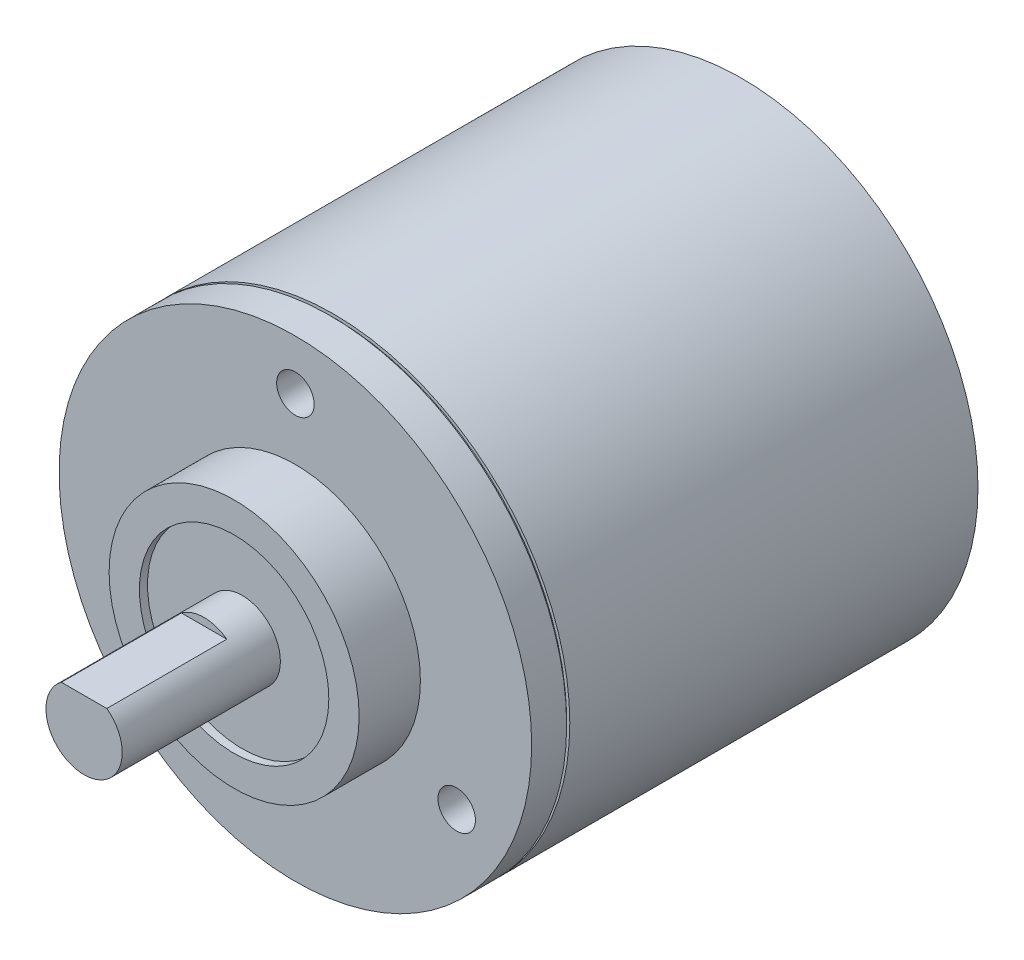
ISO-10303-21;
HEADER;
FILE_DESCRIPTION(('STEP AP214'),'2;1');
FILE_NAME('part.step','',(''),(''),'','','');
FILE_SCHEMA(('AUTOMOTIVE_DESIGN { 1 0 10303 214 1 1 1 1 }'));
ENDSEC;
DATA;
#1=APPLICATION_CONTEXT('core data for automotive mechanical design processes');
#2=APPLICATION_PROTOCOL_DEFINITION('international standard','automotive_design',2000,#1);
#3=PRODUCT_CONTEXT('',#1,'mechanical');
#4=PRODUCT('Part','Part','',(#3));
#5=PRODUCT_RELATED_PRODUCT_CATEGORY('part','',(#4));
#6=PRODUCT_DEFINITION_FORMATION('','',#4);
#7=PRODUCT_DEFINITION_CONTEXT('part definition',#1,'design');
#8=PRODUCT_DEFINITION('design','',#6,#7);
#9=PRODUCT_DEFINITION_SHAPE('','',#8);
#10=(LENGTH_UNIT() NAMED_UNIT(*) SI_UNIT(.MILLI.,.METRE.));
#11=(NAMED_UNIT(*) PLANE_ANGLE_UNIT() SI_UNIT($,.RADIAN.));
#12=(NAMED_UNIT(*) SI_UNIT($,.STERADIAN.) SOLID_ANGLE_UNIT());
#13=UNCERTAINTY_MEASURE_WITH_UNIT(LENGTH_MEASURE(1.E-05),#10,'distance_accuracy_value','');
#14=(GEOMETRIC_REPRESENTATION_CONTEXT(3) GLOBAL_UNCERTAINTY_ASSIGNED_CONTEXT((#13)) GLOBAL_UNIT_ASSIGNED_CONTEXT((#10,
#11,#12)) REPRESENTATION_CONTEXT('',''));
#15=CARTESIAN_POINT('',(0.,0.,0.));
#16=DIRECTION('',(0.,0.,1.));
#17=DIRECTION('',(1.,0.,0.));
#18=AXIS2_PLACEMENT_3D('',#15,#16,#17);
#19=CARTESIAN_POINT('',(0.,0.,-0.1));
#20=DIRECTION('',(0.,0.,1.));
#21=DIRECTION('',(1.,0.,0.));
#22=AXIS2_PLACEMENT_3D('',#19,#20,#21);
#23=CYLINDRICAL_SURFACE('',#22,18.9);
#24=CARTESIAN_POINT('',(0.,0.,32.8));
#25=DIRECTION('',(0.,0.,1.));
#26=DIRECTION('',(1.,0.,0.));
#27=AXIS2_PLACEMENT_3D('',#24,#25,#26);
#28=CIRCLE('',#27,18.9);
#29=CARTESIAN_POINT('',(18.9,0.,32.8));
#30=VERTEX_POINT('',#29);
#31=EDGE_CURVE('E38',#30,#30,#28,.F.);
#32=ORIENTED_EDGE('',*,*,#31,.F.);
#33=EDGE_LOOP('',(#32));
#34=FACE_BOUND('',#33,.T.);
#35=CARTESIAN_POINT('',(0.,0.,35.6));
#36=DIRECTION('',(0.,0.,1.));
#37=DIRECTION('',(1.,0.,0.));
#38=AXIS2_PLACEMENT_3D('',#35,#36,#37);
#39=CIRCLE('',#38,18.9);
#40=CARTESIAN_POINT('',(18.9,0.,35.6));
#41=VERTEX_POINT('',#40);
#42=EDGE_CURVE('E79',#41,#41,#39,.T.);
#43=ORIENTED_EDGE('',*,*,#42,.F.);
#44=EDGE_LOOP('',(#43));
#45=FACE_BOUND('',#44,.T.);
#46=ADVANCED_FACE('F34',(#34,#45),#23,.T.);
#47=CARTESIAN_POINT('',(0.,0.,35.6));
#48=DIRECTION('',(0.,0.,1.));
#49=DIRECTION('',(1.,0.,0.));
#50=AXIS2_PLACEMENT_3D('',#47,#48,#49);
#51=PLANE('',#50);
#52=CARTESIAN_POINT('',(-12.9037785163881,-7.45000000000006,35.6));
#53=DIRECTION('',(0.,0.,1.));
#54=DIRECTION('',(-0.500000000000004,0.866025403784436,0.));
#55=AXIS2_PLACEMENT_3D('',#52,#53,#54);
#56=CIRCLE('',#55,1.5);
#57=CARTESIAN_POINT('',(-13.6537785163881,-6.15096189432341,35.6));
#58=VERTEX_POINT('',#57);
#59=EDGE_CURVE('E112',#58,#58,#56,.T.);
#60=ORIENTED_EDGE('',*,*,#59,.F.);
#61=EDGE_LOOP('',(#60));
#62=FACE_BOUND('',#61,.T.);
#63=CARTESIAN_POINT('',(12.9037785163882,-7.44999999999988,35.6));
#64=DIRECTION('',(0.,0.,1.));
#65=DIRECTION('',(-0.499999999999992,-0.866025403784443,0.));
#66=AXIS2_PLACEMENT_3D('',#63,#64,#65);
#67=CIRCLE('',#66,1.5);
#68=CARTESIAN_POINT('',(12.1537785163882,-8.74903810567655,35.6));
#69=VERTEX_POINT('',#68);
#70=EDGE_CURVE('E101',#69,#69,#67,.T.);
#71=ORIENTED_EDGE('',*,*,#70,.F.);
#72=EDGE_LOOP('',(#71));
#73=FACE_BOUND('',#72,.T.);
#74=CARTESIAN_POINT('',(0.,14.9,35.6));
#75=DIRECTION('',(0.,0.,1.));
#76=DIRECTION('',(1.,0.,0.));
#77=AXIS2_PLACEMENT_3D('',#74,#75,#76);
#78=CIRCLE('',#77,1.5);
#79=CARTESIAN_POINT('',(1.5,14.9,35.6));
#80=VERTEX_POINT('',#79);
#81=EDGE_CURVE('E82',#80,#80,#78,.T.);
#82=ORIENTED_EDGE('',*,*,#81,.F.);
#83=EDGE_LOOP('',(#82));
#84=FACE_BOUND('',#83,.T.);
#85=CARTESIAN_POINT('',(0.,0.,35.6));
#86=DIRECTION('',(0.,0.,1.));
#87=DIRECTION('',(1.,0.,0.));
#88=AXIS2_PLACEMENT_3D('',#85,#86,#87);
#89=CIRCLE('',#88,10.);
#90=CARTESIAN_POINT('',(10.,0.,35.6));
#91=VERTEX_POINT('',#90);
#92=EDGE_CURVE('E86',#91,#91,#89,.T.);
#93=ORIENTED_EDGE('',*,*,#92,.F.);
#94=EDGE_LOOP('',(#93));
#95=FACE_BOUND('',#94,.T.);
#96=ORIENTED_EDGE('',*,*,#42,.T.);
#97=EDGE_LOOP('',(#96));
#98=FACE_BOUND('',#97,.T.);
#99=ADVANCED_FACE('F143',(#62,#73,#84,#95,#98),#51,.T.);
#100=CARTESIAN_POINT('',(0.,0.,40.5));
#101=DIRECTION('',(0.,0.,-1.));
#102=DIRECTION('',(-1.,0.,0.));
#103=AXIS2_PLACEMENT_3D('',#100,#101,#102);
#104=CYLINDRICAL_SURFACE('',#103,10.);
#105=CARTESIAN_POINT('',(0.,0.,40.5));
#106=DIRECTION('',(0.,0.,1.));
#107=DIRECTION('',(1.,0.,0.));
#108=AXIS2_PLACEMENT_3D('',#105,#106,#107);
#109=CIRCLE('',#108,10.);
#110=CARTESIAN_POINT('',(10.,0.,40.5));
#111=VERTEX_POINT('',#110);
#112=EDGE_CURVE('E75',#111,#111,#109,.T.);
#113=ORIENTED_EDGE('',*,*,#112,.F.);
#114=EDGE_LOOP('',(#113));
#115=FACE_BOUND('',#114,.T.);
#116=ORIENTED_EDGE('',*,*,#92,.T.);
#117=EDGE_LOOP('',(#116));
#118=FACE_BOUND('',#117,.T.);
#119=ADVANCED_FACE('F137',(#115,#118),#104,.T.);
#120=CARTESIAN_POINT('',(0.,0.,40.5));
#121=DIRECTION('',(0.,0.,1.));
#122=DIRECTION('',(1.,0.,0.));
#123=AXIS2_PLACEMENT_3D('',#120,#121,#122);
#124=PLANE('',#123);
#125=CARTESIAN_POINT('',(0.,0.,40.5));
#126=DIRECTION('',(0.,0.,1.));
#127=DIRECTION('',(1.,0.,0.));
#128=AXIS2_PLACEMENT_3D('',#125,#126,#127);
#129=CIRCLE('',#128,7.575);
#130=CARTESIAN_POINT('',(7.575,0.,40.5));
#131=VERTEX_POINT('',#130);
#132=EDGE_CURVE('E124',#131,#131,#129,.T.);
#133=ORIENTED_EDGE('',*,*,#132,.F.);
#134=EDGE_LOOP('',(#133));
#135=FACE_BOUND('',#134,.T.);
#136=ORIENTED_EDGE('',*,*,#112,.T.);
#137=EDGE_LOOP('',(#136));
#138=FACE_BOUND('',#137,.T.);
#139=ADVANCED_FACE('F133',(#135,#138),#124,.T.);
#140=CARTESIAN_POINT('',(0.,14.9,27.6));
#141=DIRECTION('',(0.,0.,1.));
#142=DIRECTION('',(1.,0.,0.));
#143=AXIS2_PLACEMENT_3D('',#140,#141,#142);
#144=CYLINDRICAL_SURFACE('',#143,1.5);
#145=CARTESIAN_POINT('',(0.,14.9,27.6));
#146=DIRECTION('',(0.,0.,1.));
#147=DIRECTION('',(1.,0.,0.));
#148=AXIS2_PLACEMENT_3D('',#145,#146,#147);
#149=CIRCLE('',#148,1.5);
#150=CARTESIAN_POINT('',(1.5,14.9,27.6));
#151=VERTEX_POINT('',#150);
#152=EDGE_CURVE('E76',#151,#151,#149,.T.);
#153=ORIENTED_EDGE('',*,*,#152,.F.);
#154=EDGE_LOOP('',(#153));
#155=FACE_BOUND('',#154,.T.);
#156=ORIENTED_EDGE('',*,*,#81,.T.);
#157=EDGE_LOOP('',(#156));
#158=FACE_BOUND('',#157,.T.);
#159=ADVANCED_FACE('F136',(#155,#158),#144,.F.);
#160=CARTESIAN_POINT('',(0.,14.9,27.6));
#161=DIRECTION('',(0.,0.,1.));
#162=DIRECTION('',(1.,0.,0.));
#163=AXIS2_PLACEMENT_3D('',#160,#161,#162);
#164=PLANE('',#163);
#165=ORIENTED_EDGE('',*,*,#152,.T.);
#166=EDGE_LOOP('',(#165));
#167=FACE_BOUND('',#166,.T.);
#168=ADVANCED_FACE('F181',(#167),#164,.T.);
#169=CARTESIAN_POINT('',(0.,0.,39.85));
#170=DIRECTION('',(0.,0.,1.));
#171=DIRECTION('',(1.,0.,0.));
#172=AXIS2_PLACEMENT_3D('',#169,#170,#171);
#173=CYLINDRICAL_SURFACE('',#172,7.575);
#174=CARTESIAN_POINT('',(0.,0.,39.85));
#175=DIRECTION('',(0.,0.,1.));
#176=DIRECTION('',(1.,0.,0.));
#177=AXIS2_PLACEMENT_3D('',#174,#175,#176);
#178=CIRCLE('',#177,7.575);
#179=CARTESIAN_POINT('',(7.575,0.,39.85));
#180=VERTEX_POINT('',#179);
#181=EDGE_CURVE('E125',#180,#180,#178,.T.);
#182=ORIENTED_EDGE('',*,*,#181,.F.);
#183=EDGE_LOOP('',(#182));
#184=FACE_BOUND('',#183,.T.);
#185=ORIENTED_EDGE('',*,*,#132,.T.);
#186=EDGE_LOOP('',(#185));
#187=FACE_BOUND('',#186,.T.);
#188=ADVANCED_FACE('F131',(#184,#187),#173,.F.);
#189=CARTESIAN_POINT('',(0.,0.,39.85));
#190=DIRECTION('',(0.,0.,1.));
#191=DIRECTION('',(1.,0.,0.));
#192=AXIS2_PLACEMENT_3D('',#189,#190,#191);
#193=PLANE('',#192);
#194=CARTESIAN_POINT('',(0.,0.,39.85));
#195=DIRECTION('',(0.,0.,1.));
#196=DIRECTION('',(1.,0.,0.));
#197=AXIS2_PLACEMENT_3D('',#194,#195,#196);
#198=CIRCLE('',#197,3.05);
#199=CARTESIAN_POINT('',(3.05,0.,39.85));
#200=VERTEX_POINT('',#199);
#201=EDGE_CURVE('E120',#200,#200,#198,.T.);
#202=ORIENTED_EDGE('',*,*,#201,.F.);
#203=EDGE_LOOP('',(#202));
#204=FACE_BOUND('',#203,.T.);
#205=ORIENTED_EDGE('',*,*,#181,.T.);
#206=EDGE_LOOP('',(#205));
#207=FACE_BOUND('',#206,.T.);
#208=ADVANCED_FACE('F178',(#204,#207),#193,.T.);
#209=CARTESIAN_POINT('',(0.,0.,52.5));
#210=DIRECTION('',(0.,0.,1.));
#211=DIRECTION('',(1.,0.,0.));
#212=AXIS2_PLACEMENT_3D('',#209,#210,#211);
#213=PLANE('',#212);
#214=DIRECTION('',(1.,0.,0.));
#215=VECTOR('',#214,1.);
#216=CARTESIAN_POINT('',(-4.31706966346971,2.45,52.5));
#217=LINE('',#216,#215);
#218=CARTESIAN_POINT('',(-1.81659021245849,2.45,52.5));
#219=VERTEX_POINT('',#218);
#220=CARTESIAN_POINT('',(1.81659021245849,2.45,52.5));
#221=VERTEX_POINT('',#220);
#222=EDGE_CURVE('E63',#219,#221,#217,.T.);
#223=ORIENTED_EDGE('',*,*,#222,.F.);
#224=CARTESIAN_POINT('',(0.,0.,52.5));
#225=DIRECTION('',(0.,0.,1.));
#226=DIRECTION('',(1.,0.,0.));
#227=AXIS2_PLACEMENT_3D('',#224,#225,#226);
#228=CIRCLE('',#227,3.05);
#229=EDGE_CURVE('E70',#219,#221,#228,.T.);
#230=ORIENTED_EDGE('',*,*,#229,.T.);
#231=EDGE_LOOP('',(#223,#230));
#232=FACE_BOUND('',#231,.T.);
#233=ADVANCED_FACE('F69',(#232),#213,.T.);
#234=CARTESIAN_POINT('',(0.,0.,52.5));
#235=DIRECTION('',(0.,0.,-1.));
#236=DIRECTION('',(-1.,0.,0.));
#237=AXIS2_PLACEMENT_3D('',#234,#235,#236);
#238=CYLINDRICAL_SURFACE('',#237,3.05);
#239=ORIENTED_EDGE('',*,*,#229,.F.);
#240=DIRECTION('',(0.,0.,-1.));
#241=VECTOR('',#240,1.);
#242=CARTESIAN_POINT('',(-1.81659021245849,2.45,52.5));
#243=LINE('',#242,#241);
#244=CARTESIAN_POINT('',(-1.81659021245849,2.45,42.9));
#245=VERTEX_POINT('',#244);
#246=EDGE_CURVE('E11',#219,#245,#243,.T.);
#247=ORIENTED_EDGE('',*,*,#246,.T.);
#248=CARTESIAN_POINT('',(0.,0.,42.9));
#249=DIRECTION('',(0.,0.,1.));
#250=DIRECTION('',(1.,0.,0.));
#251=AXIS2_PLACEMENT_3D('',#248,#249,#250);
#252=CIRCLE('',#251,3.05);
#253=CARTESIAN_POINT('',(1.81659021245849,2.45,42.9));
#254=VERTEX_POINT('',#253);
#255=EDGE_CURVE('E54',#254,#245,#252,.T.);
#256=ORIENTED_EDGE('',*,*,#255,.F.);
#257=DIRECTION('',(0.,0.,-1.));
#258=VECTOR('',#257,1.);
#259=CARTESIAN_POINT('',(1.81659021245849,2.45,52.5));
#260=LINE('',#259,#258);
#261=EDGE_CURVE('E43',#254,#221,#260,.F.);
#262=ORIENTED_EDGE('',*,*,#261,.T.);
#263=EDGE_LOOP('',(#239,#247,#256,#262));
#264=FACE_BOUND('',#263,.T.);
#265=ORIENTED_EDGE('',*,*,#201,.T.);
#266=EDGE_LOOP('',(#265));
#267=FACE_BOUND('',#266,.T.);
#268=ADVANCED_FACE('F73',(#264,#267),#238,.T.);
#269=CARTESIAN_POINT('',(-4.31706966346971,2.45,42.9));
#270=DIRECTION('',(0.,-1.,0.));
#271=DIRECTION('',(0.,0.,-1.));
#272=AXIS2_PLACEMENT_3D('',#269,#270,#271);
#273=PLANE('',#272);
#274=ORIENTED_EDGE('',*,*,#222,.T.);
#275=ORIENTED_EDGE('',*,*,#261,.F.);
#276=DIRECTION('',(1.,0.,0.));
#277=VECTOR('',#276,1.);
#278=CARTESIAN_POINT('',(-4.31706966346971,2.45,42.9));
#279=LINE('',#278,#277);
#280=EDGE_CURVE('E50',#245,#254,#279,.T.);
#281=ORIENTED_EDGE('',*,*,#280,.F.);
#282=ORIENTED_EDGE('',*,*,#246,.F.);
#283=EDGE_LOOP('',(#274,#275,#281,#282));
#284=FACE_BOUND('',#283,.T.);
#285=ADVANCED_FACE('F62',(#284),#273,.F.);
#286=CARTESIAN_POINT('',(0.,0.,42.9));
#287=DIRECTION('',(0.,0.,1.));
#288=DIRECTION('',(1.,0.,0.));
#289=AXIS2_PLACEMENT_3D('',#286,#287,#288);
#290=PLANE('',#289);
#291=ORIENTED_EDGE('',*,*,#255,.T.);
#292=ORIENTED_EDGE('',*,*,#280,.T.);
#293=EDGE_LOOP('',(#291,#292));
#294=FACE_BOUND('',#293,.T.);
#295=ADVANCED_FACE('F194',(#294),#290,.T.);
#296=CARTESIAN_POINT('',(12.9037785163882,-7.44999999999988,27.6));
#297=DIRECTION('',(0.,0.,1.));
#298=DIRECTION('',(1.,0.,0.));
#299=AXIS2_PLACEMENT_3D('',#296,#297,#298);
#300=CYLINDRICAL_SURFACE('',#299,1.5);
#301=CARTESIAN_POINT('',(12.9037785163882,-7.44999999999988,27.6));
#302=DIRECTION('',(0.,0.,1.));
#303=DIRECTION('',(-0.499999999999992,-0.866025403784443,0.));
#304=AXIS2_PLACEMENT_3D('',#301,#302,#303);
#305=CIRCLE('',#304,1.5);
#306=CARTESIAN_POINT('',(12.1537785163882,-8.74903810567655,27.6));
#307=VERTEX_POINT('',#306);
#308=EDGE_CURVE('E115',#307,#307,#305,.T.);
#309=ORIENTED_EDGE('',*,*,#308,.F.);
#310=EDGE_LOOP('',(#309));
#311=FACE_BOUND('',#310,.T.);
#312=ORIENTED_EDGE('',*,*,#70,.T.);
#313=EDGE_LOOP('',(#312));
#314=FACE_BOUND('',#313,.T.);
#315=ADVANCED_FACE('F197',(#311,#314),#300,.F.);
#316=CARTESIAN_POINT('',(12.9037785163882,-7.44999999999988,27.6));
#317=DIRECTION('',(0.,0.,1.));
#318=DIRECTION('',(-0.499999999999992,-0.866025403784443,0.));
#319=AXIS2_PLACEMENT_3D('',#316,#317,#318);
#320=PLANE('',#319);
#321=ORIENTED_EDGE('',*,*,#308,.T.);
#322=EDGE_LOOP('',(#321));
#323=FACE_BOUND('',#322,.T.);
#324=ADVANCED_FACE('F200',(#323),#320,.T.);
#325=CARTESIAN_POINT('',(-12.9037785163881,-7.45000000000006,27.6));
#326=DIRECTION('',(0.,0.,1.));
#327=DIRECTION('',(1.,0.,0.));
#328=AXIS2_PLACEMENT_3D('',#325,#326,#327);
#329=CYLINDRICAL_SURFACE('',#328,1.5);
#330=CARTESIAN_POINT('',(-12.9037785163881,-7.45000000000006,27.6));
#331=DIRECTION('',(0.,0.,1.));
#332=DIRECTION('',(-0.500000000000004,0.866025403784436,0.));
#333=AXIS2_PLACEMENT_3D('',#330,#331,#332);
#334=CIRCLE('',#333,1.5);
#335=CARTESIAN_POINT('',(-13.6537785163881,-6.15096189432341,27.6));
#336=VERTEX_POINT('',#335);
#337=EDGE_CURVE('E71',#336,#336,#334,.T.);
#338=ORIENTED_EDGE('',*,*,#337,.F.);
#339=EDGE_LOOP('',(#338));
#340=FACE_BOUND('',#339,.T.);
#341=ORIENTED_EDGE('',*,*,#59,.T.);
#342=EDGE_LOOP('',(#341));
#343=FACE_BOUND('',#342,.T.);
#344=ADVANCED_FACE('F204',(#340,#343),#329,.F.);
#345=CARTESIAN_POINT('',(-12.9037785163881,-7.45000000000006,27.6));
#346=DIRECTION('',(0.,0.,1.));
#347=DIRECTION('',(-0.500000000000004,0.866025403784436,0.));
#348=AXIS2_PLACEMENT_3D('',#345,#346,#347);
#349=PLANE('',#348);
#350=ORIENTED_EDGE('',*,*,#337,.T.);
#351=EDGE_LOOP('',(#350));
#352=FACE_BOUND('',#351,.T.);
#353=ADVANCED_FACE('F208',(#352),#349,.T.);
#354=CARTESIAN_POINT('',(0.,21.8461649379907,32.8));
#355=DIRECTION('',(0.,0.,1.));
#356=DIRECTION('',(1.,0.,0.));
#357=AXIS2_PLACEMENT_3D('',#354,#355,#356);
#358=PLANE('',#357);
#359=ORIENTED_EDGE('',*,*,#31,.T.);
#360=EDGE_LOOP('',(#359));
#361=FACE_BOUND('',#360,.T.);
#362=CARTESIAN_POINT('',(0.,0.,32.8));
#363=DIRECTION('',(0.,0.,-1.));
#364=DIRECTION('',(-1.,0.,0.));
#365=AXIS2_PLACEMENT_3D('',#362,#363,#364);
#366=CIRCLE('',#365,18.65);
#367=CARTESIAN_POINT('',(-18.65,0.,32.8));
#368=VERTEX_POINT('',#367);
#369=EDGE_CURVE('E97',#368,#368,#366,.T.);
#370=ORIENTED_EDGE('',*,*,#369,.F.);
#371=EDGE_LOOP('',(#370));
#372=FACE_BOUND('',#371,.T.);
#373=ADVANCED_FACE('F212',(#361,#372),#358,.F.);
#374=CARTESIAN_POINT('',(0.,0.,-0.1));
#375=DIRECTION('',(0.,0.,-1.));
#376=DIRECTION('',(-1.,0.,0.));
#377=AXIS2_PLACEMENT_3D('',#374,#375,#376);
#378=CYLINDRICAL_SURFACE('',#377,18.65);
#379=CARTESIAN_POINT('',(0.,0.,32.55));
#380=DIRECTION('',(0.,0.,-1.));
#381=DIRECTION('',(-1.,0.,0.));
#382=AXIS2_PLACEMENT_3D('',#379,#380,#381);
#383=CIRCLE('',#382,18.65);
#384=CARTESIAN_POINT('',(-18.65,0.,32.55));
#385=VERTEX_POINT('',#384);
#386=EDGE_CURVE('E103',#385,#385,#383,.T.);
#387=ORIENTED_EDGE('',*,*,#386,.F.);
#388=EDGE_LOOP('',(#387));
#389=FACE_BOUND('',#388,.T.);
#390=ORIENTED_EDGE('',*,*,#369,.T.);
#391=EDGE_LOOP('',(#390));
#392=FACE_BOUND('',#391,.T.);
#393=ADVANCED_FACE('F171',(#389,#392),#378,.T.);
#394=CARTESIAN_POINT('',(0.,21.8461649379907,32.55));
#395=DIRECTION('',(0.,0.,-1.));
#396=DIRECTION('',(-1.,0.,0.));
#397=AXIS2_PLACEMENT_3D('',#394,#395,#396);
#398=PLANE('',#397);
#399=CARTESIAN_POINT('',(0.,0.,32.55));
#400=DIRECTION('',(0.,0.,-1.));
#401=DIRECTION('',(-1.,0.,0.));
#402=AXIS2_PLACEMENT_3D('',#399,#400,#401);
#403=CIRCLE('',#402,18.9);
#404=CARTESIAN_POINT('',(-18.9,0.,32.55));
#405=VERTEX_POINT('',#404);
#406=EDGE_CURVE('E95',#405,#405,#403,.F.);
#407=ORIENTED_EDGE('',*,*,#406,.T.);
#408=EDGE_LOOP('',(#407));
#409=FACE_BOUND('',#408,.T.);
#410=ORIENTED_EDGE('',*,*,#386,.T.);
#411=EDGE_LOOP('',(#410));
#412=FACE_BOUND('',#411,.T.);
#413=ADVANCED_FACE('F164',(#409,#412),#398,.F.);
#414=CARTESIAN_POINT('',(0.,0.,-0.1));
#415=DIRECTION('',(0.,0.,1.));
#416=DIRECTION('',(1.,0.,0.));
#417=AXIS2_PLACEMENT_3D('',#414,#415,#416);
#418=PLANE('',#417);
#419=CARTESIAN_POINT('',(0.,0.,-0.1));
#420=DIRECTION('',(0.,0.,1.));
#421=DIRECTION('',(1.,0.,0.));
#422=AXIS2_PLACEMENT_3D('',#419,#420,#421);
#423=CIRCLE('',#422,18.9);
#424=CARTESIAN_POINT('',(18.9,0.,-0.1));
#425=VERTEX_POINT('',#424);
#426=EDGE_CURVE('E89',#425,#425,#423,.T.);
#427=ORIENTED_EDGE('',*,*,#426,.F.);
#428=EDGE_LOOP('',(#427));
#429=FACE_BOUND('',#428,.T.);
#430=ADVANCED_FACE('F159',(#429),#418,.F.);
#431=ORIENTED_EDGE('',*,*,#406,.F.);
#432=EDGE_LOOP('',(#431));
#433=FACE_BOUND('',#432,.T.);
#434=ORIENTED_EDGE('',*,*,#426,.T.);
#435=EDGE_LOOP('',(#434));
#436=FACE_BOUND('',#435,.T.);
#437=ADVANCED_FACE('F36',(#433,#436),#23,.T.);
#438=CLOSED_SHELL('',(#46,#99,#119,#139,#159,#168,#188,#208,#233,#268,#285,#295,#315,#324,#344,
#353,#373,#393,#413,#430,#437));
#439=MANIFOLD_SOLID_BREP('B2',#438);
#440=ADVANCED_BREP_SHAPE_REPRESENTATION('',(#18,#439),#14);
#441=SHAPE_DEFINITION_REPRESENTATION(#9,#440);
ENDSEC;
END-ISO-10303-21;
